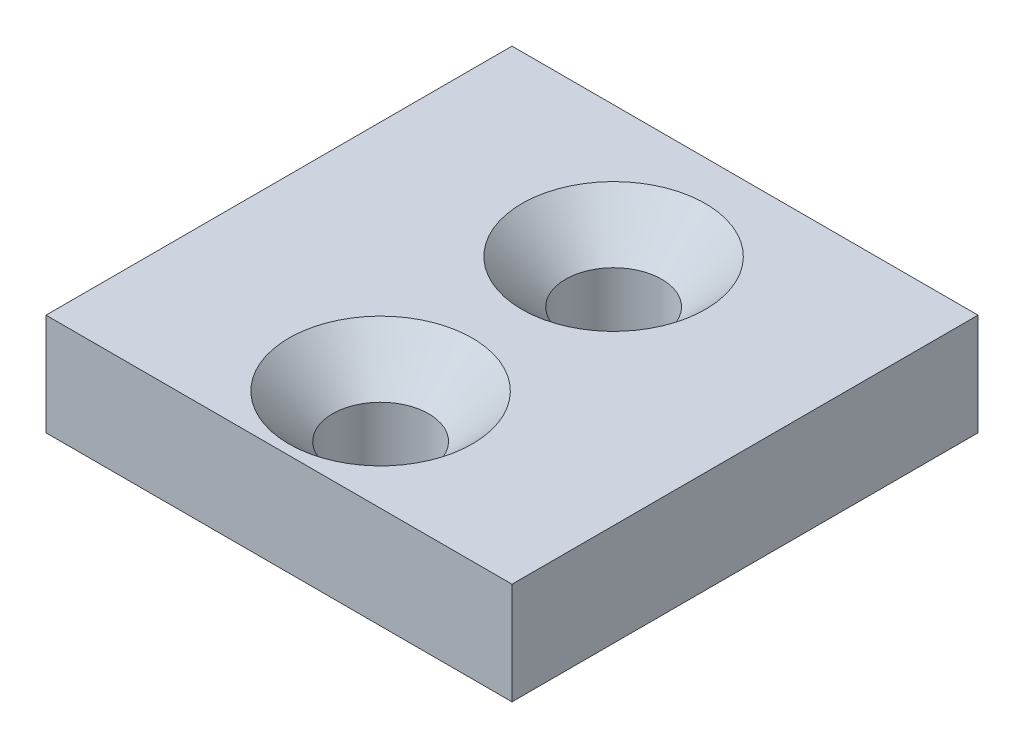
ISO-10303-21;
HEADER;
FILE_DESCRIPTION(('STEP AP214'),'2;1');
FILE_NAME('part.step','',(''),(''),'','','');
FILE_SCHEMA(('AUTOMOTIVE_DESIGN { 1 0 10303 214 1 1 1 1 }'));
ENDSEC;
DATA;
#1=APPLICATION_CONTEXT('core data for automotive mechanical design processes');
#2=APPLICATION_PROTOCOL_DEFINITION('international standard','automotive_design',2000,#1);
#3=PRODUCT_CONTEXT('',#1,'mechanical');
#4=PRODUCT('Part','Part','',(#3));
#5=PRODUCT_RELATED_PRODUCT_CATEGORY('part','',(#4));
#6=PRODUCT_DEFINITION_FORMATION('','',#4);
#7=PRODUCT_DEFINITION_CONTEXT('part definition',#1,'design');
#8=PRODUCT_DEFINITION('design','',#6,#7);
#9=PRODUCT_DEFINITION_SHAPE('','',#8);
#10=(LENGTH_UNIT() NAMED_UNIT(*) SI_UNIT(.MILLI.,.METRE.));
#11=(NAMED_UNIT(*) PLANE_ANGLE_UNIT() SI_UNIT($,.RADIAN.));
#12=(NAMED_UNIT(*) SI_UNIT($,.STERADIAN.) SOLID_ANGLE_UNIT());
#13=UNCERTAINTY_MEASURE_WITH_UNIT(LENGTH_MEASURE(1.E-05),#10,'distance_accuracy_value','');
#14=(GEOMETRIC_REPRESENTATION_CONTEXT(3) GLOBAL_UNCERTAINTY_ASSIGNED_CONTEXT((#13)) GLOBAL_UNIT_ASSIGNED_CONTEXT((#10,
#11,#12)) REPRESENTATION_CONTEXT('',''));
#15=CARTESIAN_POINT('',(0.,0.,0.));
#16=DIRECTION('',(0.,0.,1.));
#17=DIRECTION('',(1.,0.,0.));
#18=AXIS2_PLACEMENT_3D('',#15,#16,#17);
#19=CARTESIAN_POINT('',(0.,7.,0.));
#20=DIRECTION('',(-1.,0.,0.));
#21=DIRECTION('',(0.,0.,1.));
#22=AXIS2_PLACEMENT_3D('',#19,#20,#21);
#23=PLANE('',#22);
#24=DIRECTION('',(0.,0.,-1.));
#25=VECTOR('',#24,1.);
#26=CARTESIAN_POINT('',(0.,0.,0.));
#27=LINE('',#26,#25);
#28=CARTESIAN_POINT('',(0.,0.,0.));
#29=VERTEX_POINT('',#28);
#30=CARTESIAN_POINT('',(0.,0.,-32.));
#31=VERTEX_POINT('',#30);
#32=EDGE_CURVE('E100',#29,#31,#27,.T.);
#33=ORIENTED_EDGE('',*,*,#32,.T.);
#34=DIRECTION('',(0.,-1.,0.));
#35=VECTOR('',#34,1.);
#36=CARTESIAN_POINT('',(0.,7.,-32.));
#37=LINE('',#36,#35);
#38=CARTESIAN_POINT('',(0.,7.,-32.));
#39=VERTEX_POINT('',#38);
#40=EDGE_CURVE('E11',#39,#31,#37,.T.);
#41=ORIENTED_EDGE('',*,*,#40,.F.);
#42=DIRECTION('',(0.,0.,-1.));
#43=VECTOR('',#42,1.);
#44=CARTESIAN_POINT('',(0.,7.,0.));
#45=LINE('',#44,#43);
#46=CARTESIAN_POINT('',(0.,7.,0.));
#47=VERTEX_POINT('',#46);
#48=EDGE_CURVE('E88',#47,#39,#45,.T.);
#49=ORIENTED_EDGE('',*,*,#48,.F.);
#50=DIRECTION('',(0.,-1.,0.));
#51=VECTOR('',#50,1.);
#52=CARTESIAN_POINT('',(0.,7.,0.));
#53=LINE('',#52,#51);
#54=EDGE_CURVE('E96',#47,#29,#53,.T.);
#55=ORIENTED_EDGE('',*,*,#54,.T.);
#56=EDGE_LOOP('',(#33,#41,#49,#55));
#57=FACE_BOUND('',#56,.T.);
#58=ADVANCED_FACE('F37',(#57),#23,.F.);
#59=CARTESIAN_POINT('',(0.,7.,-32.));
#60=DIRECTION('',(0.,0.,1.));
#61=DIRECTION('',(1.,0.,0.));
#62=AXIS2_PLACEMENT_3D('',#59,#60,#61);
#63=PLANE('',#62);
#64=DIRECTION('',(-1.,0.,0.));
#65=VECTOR('',#64,1.);
#66=CARTESIAN_POINT('',(0.,0.,-32.));
#67=LINE('',#66,#65);
#68=CARTESIAN_POINT('',(-32.,0.,-32.));
#69=VERTEX_POINT('',#68);
#70=EDGE_CURVE('E92',#31,#69,#67,.T.);
#71=ORIENTED_EDGE('',*,*,#70,.T.);
#72=DIRECTION('',(0.,-1.,0.));
#73=VECTOR('',#72,1.);
#74=CARTESIAN_POINT('',(-32.,7.,-32.));
#75=LINE('',#74,#73);
#76=CARTESIAN_POINT('',(-32.,7.,-32.));
#77=VERTEX_POINT('',#76);
#78=EDGE_CURVE('E45',#77,#69,#75,.T.);
#79=ORIENTED_EDGE('',*,*,#78,.F.);
#80=DIRECTION('',(-1.,0.,0.));
#81=VECTOR('',#80,1.);
#82=CARTESIAN_POINT('',(0.,7.,-32.));
#83=LINE('',#82,#81);
#84=EDGE_CURVE('E83',#39,#77,#83,.T.);
#85=ORIENTED_EDGE('',*,*,#84,.F.);
#86=ORIENTED_EDGE('',*,*,#40,.T.);
#87=EDGE_LOOP('',(#71,#79,#85,#86));
#88=FACE_BOUND('',#87,.T.);
#89=ADVANCED_FACE('F91',(#88),#63,.F.);
#90=CARTESIAN_POINT('',(-32.,7.,0.));
#91=DIRECTION('',(1.,0.,0.));
#92=DIRECTION('',(0.,0.,-1.));
#93=AXIS2_PLACEMENT_3D('',#90,#91,#92);
#94=PLANE('',#93);
#95=DIRECTION('',(0.,0.,1.));
#96=VECTOR('',#95,1.);
#97=CARTESIAN_POINT('',(-32.,0.,0.));
#98=LINE('',#97,#96);
#99=CARTESIAN_POINT('',(-32.,0.,0.));
#100=VERTEX_POINT('',#99);
#101=EDGE_CURVE('E70',#69,#100,#98,.T.);
#102=ORIENTED_EDGE('',*,*,#101,.T.);
#103=DIRECTION('',(0.,-1.,0.));
#104=VECTOR('',#103,1.);
#105=CARTESIAN_POINT('',(-32.,7.,0.));
#106=LINE('',#105,#104);
#107=CARTESIAN_POINT('',(-32.,7.,0.));
#108=VERTEX_POINT('',#107);
#109=EDGE_CURVE('E93',#108,#100,#106,.T.);
#110=ORIENTED_EDGE('',*,*,#109,.F.);
#111=DIRECTION('',(0.,0.,1.));
#112=VECTOR('',#111,1.);
#113=CARTESIAN_POINT('',(-32.,7.,0.));
#114=LINE('',#113,#112);
#115=EDGE_CURVE('E86',#77,#108,#114,.T.);
#116=ORIENTED_EDGE('',*,*,#115,.F.);
#117=ORIENTED_EDGE('',*,*,#78,.T.);
#118=EDGE_LOOP('',(#102,#110,#116,#117));
#119=FACE_BOUND('',#118,.T.);
#120=ADVANCED_FACE('F94',(#119),#94,.F.);
#121=CARTESIAN_POINT('',(0.,7.,0.));
#122=DIRECTION('',(0.,0.,-1.));
#123=DIRECTION('',(-1.,0.,0.));
#124=AXIS2_PLACEMENT_3D('',#121,#122,#123);
#125=PLANE('',#124);
#126=DIRECTION('',(1.,0.,0.));
#127=VECTOR('',#126,1.);
#128=CARTESIAN_POINT('',(0.,0.,0.));
#129=LINE('',#128,#127);
#130=EDGE_CURVE('E76',#100,#29,#129,.T.);
#131=ORIENTED_EDGE('',*,*,#130,.T.);
#132=ORIENTED_EDGE('',*,*,#54,.F.);
#133=DIRECTION('',(1.,0.,0.));
#134=VECTOR('',#133,1.);
#135=CARTESIAN_POINT('',(0.,7.,0.));
#136=LINE('',#135,#134);
#137=EDGE_CURVE('E53',#108,#47,#136,.T.);
#138=ORIENTED_EDGE('',*,*,#137,.F.);
#139=ORIENTED_EDGE('',*,*,#109,.T.);
#140=EDGE_LOOP('',(#131,#132,#138,#139));
#141=FACE_BOUND('',#140,.T.);
#142=ADVANCED_FACE('F108',(#141),#125,.F.);
#143=CARTESIAN_POINT('',(0.,7.,0.));
#144=DIRECTION('',(0.,1.,0.));
#145=DIRECTION('',(0.,0.,1.));
#146=AXIS2_PLACEMENT_3D('',#143,#144,#145);
#147=PLANE('',#146);
#148=CARTESIAN_POINT('',(-16.,7.,-22.9770766477355));
#149=DIRECTION('',(0.,1.,0.));
#150=DIRECTION('',(0.,0.,1.));
#151=AXIS2_PLACEMENT_3D('',#148,#149,#150);
#152=CIRCLE('',#151,6.3);
#153=CARTESIAN_POINT('',(-16.,7.,-16.6770766477355));
#154=VERTEX_POINT('',#153);
#155=EDGE_CURVE('E128',#154,#154,#152,.T.);
#156=ORIENTED_EDGE('',*,*,#155,.F.);
#157=EDGE_LOOP('',(#156));
#158=FACE_BOUND('',#157,.T.);
#159=CARTESIAN_POINT('',(-16.,7.,-6.97707664773553));
#160=DIRECTION('',(0.,1.,0.));
#161=DIRECTION('',(0.,0.,1.));
#162=AXIS2_PLACEMENT_3D('',#159,#160,#161);
#163=CIRCLE('',#162,6.3);
#164=CARTESIAN_POINT('',(-16.,7.,-0.677076647735531));
#165=VERTEX_POINT('',#164);
#166=EDGE_CURVE('E119',#165,#165,#163,.T.);
#167=ORIENTED_EDGE('',*,*,#166,.F.);
#168=EDGE_LOOP('',(#167));
#169=FACE_BOUND('',#168,.T.);
#170=ORIENTED_EDGE('',*,*,#48,.T.);
#171=ORIENTED_EDGE('',*,*,#84,.T.);
#172=ORIENTED_EDGE('',*,*,#115,.T.);
#173=ORIENTED_EDGE('',*,*,#137,.T.);
#174=EDGE_LOOP('',(#170,#171,#172,#173));
#175=FACE_BOUND('',#174,.T.);
#176=ADVANCED_FACE('F84',(#158,#169,#175),#147,.T.);
#177=CARTESIAN_POINT('',(0.,0.,0.));
#178=DIRECTION('',(0.,1.,0.));
#179=DIRECTION('',(0.,0.,1.));
#180=AXIS2_PLACEMENT_3D('',#177,#178,#179);
#181=PLANE('',#180);
#182=CARTESIAN_POINT('',(-16.,0.,-22.9770766477355));
#183=DIRECTION('',(0.,1.,0.));
#184=DIRECTION('',(0.,0.,1.));
#185=AXIS2_PLACEMENT_3D('',#182,#183,#184);
#186=CIRCLE('',#185,3.3);
#187=CARTESIAN_POINT('',(-16.,0.,-19.6770766477355));
#188=VERTEX_POINT('',#187);
#189=EDGE_CURVE('E122',#188,#188,#186,.T.);
#190=ORIENTED_EDGE('',*,*,#189,.T.);
#191=EDGE_LOOP('',(#190));
#192=FACE_BOUND('',#191,.T.);
#193=CARTESIAN_POINT('',(-16.,0.,-6.97707664773553));
#194=DIRECTION('',(0.,1.,0.));
#195=DIRECTION('',(0.,0.,1.));
#196=AXIS2_PLACEMENT_3D('',#193,#194,#195);
#197=CIRCLE('',#196,3.3);
#198=CARTESIAN_POINT('',(-16.,0.,-3.67707664773553));
#199=VERTEX_POINT('',#198);
#200=EDGE_CURVE('E103',#199,#199,#197,.T.);
#201=ORIENTED_EDGE('',*,*,#200,.T.);
#202=EDGE_LOOP('',(#201));
#203=FACE_BOUND('',#202,.T.);
#204=ORIENTED_EDGE('',*,*,#32,.F.);
#205=ORIENTED_EDGE('',*,*,#130,.F.);
#206=ORIENTED_EDGE('',*,*,#101,.F.);
#207=ORIENTED_EDGE('',*,*,#70,.F.);
#208=EDGE_LOOP('',(#204,#205,#206,#207));
#209=FACE_BOUND('',#208,.T.);
#210=ADVANCED_FACE('F111',(#192,#203,#209),#181,.F.);
#211=CARTESIAN_POINT('',(-16.,7.,-6.97707664773553));
#212=DIRECTION('',(0.,1.,0.));
#213=DIRECTION('',(0.,0.,1.));
#214=AXIS2_PLACEMENT_3D('',#211,#212,#213);
#215=CYLINDRICAL_SURFACE('',#214,3.3);
#216=ORIENTED_EDGE('',*,*,#200,.F.);
#217=EDGE_LOOP('',(#216));
#218=FACE_BOUND('',#217,.T.);
#219=CARTESIAN_POINT('',(-16.,4.00000000000001,-6.97707664773553));
#220=DIRECTION('',(0.,1.,0.));
#221=DIRECTION('',(0.,0.,1.));
#222=AXIS2_PLACEMENT_3D('',#219,#220,#221);
#223=CIRCLE('',#222,3.3);
#224=CARTESIAN_POINT('',(-16.,4.00000000000001,-3.67707664773553));
#225=VERTEX_POINT('',#224);
#226=EDGE_CURVE('E116',#225,#225,#223,.T.);
#227=ORIENTED_EDGE('',*,*,#226,.T.);
#228=EDGE_LOOP('',(#227));
#229=FACE_BOUND('',#228,.T.);
#230=ADVANCED_FACE('F142',(#218,#229),#215,.F.);
#231=CARTESIAN_POINT('',(-16.,7.,-6.97707664773553));
#232=DIRECTION('',(0.,1.,0.));
#233=DIRECTION('',(0.,0.,1.));
#234=AXIS2_PLACEMENT_3D('',#231,#232,#233);
#235=CONICAL_SURFACE('',#234,6.3,0.78539816339745);
#236=ORIENTED_EDGE('',*,*,#226,.F.);
#237=EDGE_LOOP('',(#236));
#238=FACE_BOUND('',#237,.T.);
#239=ORIENTED_EDGE('',*,*,#166,.T.);
#240=EDGE_LOOP('',(#239));
#241=FACE_BOUND('',#240,.T.);
#242=ADVANCED_FACE('F139',(#238,#241),#235,.F.);
#243=CARTESIAN_POINT('',(-16.,7.,-22.9770766477355));
#244=DIRECTION('',(0.,1.,0.));
#245=DIRECTION('',(0.,0.,1.));
#246=AXIS2_PLACEMENT_3D('',#243,#244,#245);
#247=CYLINDRICAL_SURFACE('',#246,3.3);
#248=ORIENTED_EDGE('',*,*,#189,.F.);
#249=EDGE_LOOP('',(#248));
#250=FACE_BOUND('',#249,.T.);
#251=CARTESIAN_POINT('',(-16.,4.00000000000001,-22.9770766477355));
#252=DIRECTION('',(0.,1.,0.));
#253=DIRECTION('',(0.,0.,1.));
#254=AXIS2_PLACEMENT_3D('',#251,#252,#253);
#255=CIRCLE('',#254,3.3);
#256=CARTESIAN_POINT('',(-16.,4.00000000000001,-19.6770766477355));
#257=VERTEX_POINT('',#256);
#258=EDGE_CURVE('E125',#257,#257,#255,.T.);
#259=ORIENTED_EDGE('',*,*,#258,.T.);
#260=EDGE_LOOP('',(#259));
#261=FACE_BOUND('',#260,.T.);
#262=ADVANCED_FACE('F141',(#250,#261),#247,.F.);
#263=CARTESIAN_POINT('',(-16.,7.,-22.9770766477355));
#264=DIRECTION('',(0.,1.,0.));
#265=DIRECTION('',(0.,0.,1.));
#266=AXIS2_PLACEMENT_3D('',#263,#264,#265);
#267=CONICAL_SURFACE('',#266,6.3,0.78539816339745);
#268=ORIENTED_EDGE('',*,*,#258,.F.);
#269=EDGE_LOOP('',(#268));
#270=FACE_BOUND('',#269,.T.);
#271=ORIENTED_EDGE('',*,*,#155,.T.);
#272=EDGE_LOOP('',(#271));
#273=FACE_BOUND('',#272,.T.);
#274=ADVANCED_FACE('F132',(#270,#273),#267,.F.);
#275=CLOSED_SHELL('',(#58,#89,#120,#142,#176,#210,#230,#242,#262,#274));
#276=MANIFOLD_SOLID_BREP('B2',#275);
#277=ADVANCED_BREP_SHAPE_REPRESENTATION('',(#18,#276),#14);
#278=SHAPE_DEFINITION_REPRESENTATION(#9,#277);
ENDSEC;
END-ISO-10303-21;
